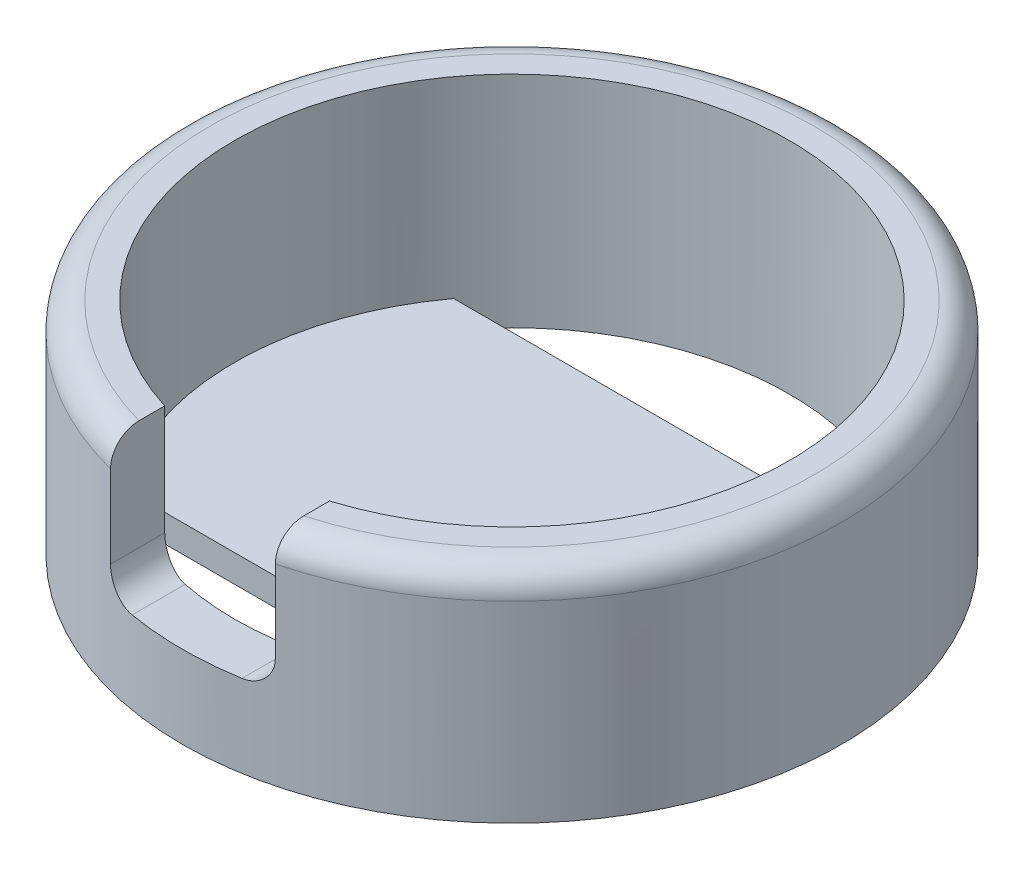
ISO-10303-21;
HEADER;
FILE_DESCRIPTION(('STEP AP214'),'2;1');
FILE_NAME('part.step','',(''),(''),'','','');
FILE_SCHEMA(('AUTOMOTIVE_DESIGN { 1 0 10303 214 1 1 1 1 }'));
ENDSEC;
DATA;
#1=APPLICATION_CONTEXT('core data for automotive mechanical design processes');
#2=APPLICATION_PROTOCOL_DEFINITION('international standard','automotive_design',2000,#1);
#3=PRODUCT_CONTEXT('',#1,'mechanical');
#4=PRODUCT('Part','Part','',(#3));
#5=PRODUCT_RELATED_PRODUCT_CATEGORY('part','',(#4));
#6=PRODUCT_DEFINITION_FORMATION('','',#4);
#7=PRODUCT_DEFINITION_CONTEXT('part definition',#1,'design');
#8=PRODUCT_DEFINITION('design','',#6,#7);
#9=PRODUCT_DEFINITION_SHAPE('','',#8);
#10=(LENGTH_UNIT() NAMED_UNIT(*) SI_UNIT(.MILLI.,.METRE.));
#11=(NAMED_UNIT(*) PLANE_ANGLE_UNIT() SI_UNIT($,.RADIAN.));
#12=(NAMED_UNIT(*) SI_UNIT($,.STERADIAN.) SOLID_ANGLE_UNIT());
#13=UNCERTAINTY_MEASURE_WITH_UNIT(LENGTH_MEASURE(1.E-05),#10,'distance_accuracy_value','');
#14=(GEOMETRIC_REPRESENTATION_CONTEXT(3) GLOBAL_UNCERTAINTY_ASSIGNED_CONTEXT((#13)) GLOBAL_UNIT_ASSIGNED_CONTEXT((#10,
#11,#12)) REPRESENTATION_CONTEXT('',''));
#15=CARTESIAN_POINT('',(0.,0.,0.));
#16=DIRECTION('',(0.,0.,1.));
#17=DIRECTION('',(1.,0.,0.));
#18=AXIS2_PLACEMENT_3D('',#15,#16,#17);
#19=CARTESIAN_POINT('',(0.,0.,0.));
#20=DIRECTION('',(0.,-1.,0.));
#21=DIRECTION('',(0.,0.,-1.));
#22=AXIS2_PLACEMENT_3D('',#19,#20,#21);
#23=PLANE('',#22);
#24=CARTESIAN_POINT('',(0.,0.,0.));
#25=DIRECTION('',(0.,1.,0.));
#26=DIRECTION('',(0.,0.,1.));
#27=AXIS2_PLACEMENT_3D('',#24,#25,#26);
#28=CIRCLE('',#27,5.05);
#29=CARTESIAN_POINT('',(4.06232691938992,0.,3.));
#30=VERTEX_POINT('',#29);
#31=CARTESIAN_POINT('',(4.06232691938992,0.,-3.));
#32=VERTEX_POINT('',#31);
#33=EDGE_CURVE('E172',#30,#32,#28,.T.);
#34=ORIENTED_EDGE('',*,*,#33,.T.);
#35=DIRECTION('',(1.,0.,0.));
#36=VECTOR('',#35,1.);
#37=CARTESIAN_POINT('',(4.06232691938992,0.,-3.));
#38=LINE('',#37,#36);
#39=CARTESIAN_POINT('',(-4.06232691938992,0.,-3.));
#40=VERTEX_POINT('',#39);
#41=EDGE_CURVE('E141',#40,#32,#38,.T.);
#42=ORIENTED_EDGE('',*,*,#41,.F.);
#43=CARTESIAN_POINT('',(-4.06232691938992,0.,3.));
#44=VERTEX_POINT('',#43);
#45=EDGE_CURVE('E129',#40,#44,#28,.T.);
#46=ORIENTED_EDGE('',*,*,#45,.T.);
#47=DIRECTION('',(-1.,0.,0.));
#48=VECTOR('',#47,1.);
#49=CARTESIAN_POINT('',(4.06232691938992,0.,3.));
#50=LINE('',#49,#48);
#51=EDGE_CURVE('E145',#30,#44,#50,.T.);
#52=ORIENTED_EDGE('',*,*,#51,.F.);
#53=EDGE_LOOP('',(#34,#42,#46,#52));
#54=FACE_BOUND('',#53,.T.);
#55=ADVANCED_FACE('F32',(#54),#23,.F.);
#56=CARTESIAN_POINT('',(0.,3.5,0.));
#57=DIRECTION('',(0.,1.,0.));
#58=DIRECTION('',(0.,0.,1.));
#59=AXIS2_PLACEMENT_3D('',#56,#57,#58);
#60=PLANE('',#59);
#61=DIRECTION('',(0.,0.,1.));
#62=VECTOR('',#61,1.);
#63=CARTESIAN_POINT('',(1.5,3.5,6.));
#64=LINE('',#63,#62);
#65=CARTESIAN_POINT('',(1.5,3.5,4.82208461145177));
#66=VERTEX_POINT('',#65);
#67=CARTESIAN_POINT('',(1.5,3.5,5.29150262212918));
#68=VERTEX_POINT('',#67);
#69=EDGE_CURVE('E156',#66,#68,#64,.T.);
#70=ORIENTED_EDGE('',*,*,#69,.T.);
#71=CARTESIAN_POINT('',(0.,3.5,0.));
#72=DIRECTION('',(0.,1.,0.));
#73=DIRECTION('',(0.,0.,1.));
#74=AXIS2_PLACEMENT_3D('',#71,#72,#73);
#75=CIRCLE('',#74,5.5);
#76=CARTESIAN_POINT('',(-1.5,3.5,5.29150262212918));
#77=VERTEX_POINT('',#76);
#78=EDGE_CURVE('E206',#68,#77,#75,.T.);
#79=ORIENTED_EDGE('',*,*,#78,.T.);
#80=DIRECTION('',(0.,0.,-1.));
#81=VECTOR('',#80,1.);
#82=CARTESIAN_POINT('',(-1.5,3.5,6.));
#83=LINE('',#82,#81);
#84=CARTESIAN_POINT('',(-1.5,3.5,4.82208461145177));
#85=VERTEX_POINT('',#84);
#86=EDGE_CURVE('E275',#77,#85,#83,.T.);
#87=ORIENTED_EDGE('',*,*,#86,.T.);
#88=CARTESIAN_POINT('',(0.,3.5,0.));
#89=DIRECTION('',(0.,1.,0.));
#90=DIRECTION('',(0.,0.,1.));
#91=AXIS2_PLACEMENT_3D('',#88,#89,#90);
#92=CIRCLE('',#91,5.05);
#93=EDGE_CURVE('E256',#66,#85,#92,.T.);
#94=ORIENTED_EDGE('',*,*,#93,.F.);
#95=EDGE_LOOP('',(#70,#79,#87,#94));
#96=FACE_BOUND('',#95,.T.);
#97=ADVANCED_FACE('F228',(#96),#60,.T.);
#98=CARTESIAN_POINT('',(0.,3.5,0.));
#99=DIRECTION('',(0.,-1.,0.));
#100=DIRECTION('',(0.,0.,-1.));
#101=AXIS2_PLACEMENT_3D('',#98,#99,#100);
#102=CYLINDRICAL_SURFACE('',#101,6.);
#103=CARTESIAN_POINT('',(0.,-0.5,0.));
#104=DIRECTION('',(0.,-1.,0.));
#105=DIRECTION('',(0.,0.,-1.));
#106=AXIS2_PLACEMENT_3D('',#103,#104,#105);
#107=CIRCLE('',#106,6.);
#108=CARTESIAN_POINT('',(0.,-0.5,-6.));
#109=VERTEX_POINT('',#108);
#110=EDGE_CURVE('E173',#109,#109,#107,.T.);
#111=ORIENTED_EDGE('',*,*,#110,.F.);
#112=EDGE_LOOP('',(#111));
#113=FACE_BOUND('',#112,.T.);
#114=DIRECTION('',(0.,-1.,0.));
#115=VECTOR('',#114,1.);
#116=CARTESIAN_POINT('',(-1.5,3.5,5.80947501931113));
#117=LINE('',#116,#115);
#118=CARTESIAN_POINT('',(-1.5,3.,5.80947501931113));
#119=VERTEX_POINT('',#118);
#120=CARTESIAN_POINT('',(-1.5,1.5,5.80947501931113));
#121=VERTEX_POINT('',#120);
#122=EDGE_CURVE('E265',#119,#121,#117,.T.);
#123=ORIENTED_EDGE('',*,*,#122,.F.);
#124=CARTESIAN_POINT('',(0.,3.,0.));
#125=DIRECTION('',(0.,1.,0.));
#126=DIRECTION('',(0.,0.,1.));
#127=AXIS2_PLACEMENT_3D('',#124,#125,#126);
#128=CIRCLE('',#127,6.);
#129=CARTESIAN_POINT('',(1.5,3.,5.80947501931113));
#130=VERTEX_POINT('',#129);
#131=EDGE_CURVE('E209',#119,#130,#128,.F.);
#132=ORIENTED_EDGE('',*,*,#131,.T.);
#133=DIRECTION('',(0.,-1.,0.));
#134=VECTOR('',#133,1.);
#135=CARTESIAN_POINT('',(1.5,3.5,5.80947501931113));
#136=LINE('',#135,#134);
#137=CARTESIAN_POINT('',(1.5,1.5,5.80947501931113));
#138=VERTEX_POINT('',#137);
#139=EDGE_CURVE('E263',#138,#130,#136,.F.);
#140=ORIENTED_EDGE('',*,*,#139,.F.);
#141=CARTESIAN_POINT('',(1.5,1.5,5.80947501931113));
#142=CARTESIAN_POINT('',(1.5000264388775,1.47245234394303,5.80946260272225));
#143=CARTESIAN_POINT('',(1.49772513568713,1.44491875321877,5.81006232529152));
#144=CARTESIAN_POINT('',(1.48867054127598,1.39069268979506,5.81239183886436));
#145=CARTESIAN_POINT('',(1.48192543696267,1.36399876473653,5.81411955169529));
#146=CARTESIAN_POINT('',(1.46418467978733,1.31215613754131,5.81861164863412));
#147=CARTESIAN_POINT('',(1.45318868844561,1.28700755863868,5.82137611529369));
#148=CARTESIAN_POINT('',(1.42730002983229,1.23892533964038,5.82777770640467));
#149=CARTESIAN_POINT('',(1.41240679471109,1.21599202298769,5.83141495801916));
#150=CARTESIAN_POINT('',(1.37888943193051,1.17257483931313,5.83943185842595));
#151=CARTESIAN_POINT('',(1.36020865851627,1.15213678395909,5.8438226013859));
#152=CARTESIAN_POINT('',(1.31979926314509,1.11465845161131,5.85308115729669));
#153=CARTESIAN_POINT('',(1.29806979139856,1.09761912519205,5.85794910314797));
#154=CARTESIAN_POINT('',(1.25151686538783,1.06694381207257,5.86807359237805));
#155=CARTESIAN_POINT('',(1.22662470361615,1.05341443104465,5.87333714435984));
#156=CARTESIAN_POINT('',(1.17492720494232,1.03074930338266,5.88389673242732));
#157=CARTESIAN_POINT('',(1.14812272134344,1.02161161102753,5.88919275307265));
#158=CARTESIAN_POINT('',(1.1010233989768,1.00989039601375,5.89814802867448));
#159=CARTESIAN_POINT('',(1.08100778606736,1.00618802406004,5.90185029888455));
#160=CARTESIAN_POINT('',(1.04067055279438,1.00124239117992,5.90909720818695));
#161=CARTESIAN_POINT('',(1.02034929701292,0.99999640343558,5.91264201779594));
#162=CARTESIAN_POINT('',(1.,1.,5.91607978309962));
#163=B_SPLINE_CURVE_WITH_KNOTS('',3,(#141,#142,#143,#144,#145,#146,#147,#148,#149,#150,#151,
#152,#153,#154,#155,#156,#157,#158,#159,#160,#161,#162),.UNSPECIFIED.,.F.,.F.,(4,2,2,2,2,2,2,2,
2,2,4),(0.,0.0825190739674022,0.164886544864223,0.247260575676911,0.329646615522718,
0.413370197857709,0.497117163713627,0.583169637417716,0.669183950673288,0.731109654210457,
0.792966575586024),.UNSPECIFIED.);
#164=CARTESIAN_POINT('',(1.,1.,5.91607978309962));
#165=VERTEX_POINT('',#164);
#166=EDGE_CURVE('E45',#138,#165,#163,.T.);
#167=ORIENTED_EDGE('',*,*,#166,.T.);
#168=CARTESIAN_POINT('',(0.,1.,0.));
#169=DIRECTION('',(0.,1.,0.));
#170=DIRECTION('',(0.,0.,1.));
#171=AXIS2_PLACEMENT_3D('',#168,#169,#170);
#172=CIRCLE('',#171,6.);
#173=CARTESIAN_POINT('',(-1.,1.,5.91607978309962));
#174=VERTEX_POINT('',#173);
#175=EDGE_CURVE('E268',#174,#165,#172,.T.);
#176=ORIENTED_EDGE('',*,*,#175,.F.);
#177=CARTESIAN_POINT('',(-1.,1.,5.91607978309962));
#178=CARTESIAN_POINT('',(-1.02863076528655,0.999978854490423,5.91124844688036));
#179=CARTESIAN_POINT('',(-1.0572122635172,1.00245763755017,5.90619562137501));
#180=CARTESIAN_POINT('',(-1.11347612360845,1.01221729737715,5.89584284522348));
#181=CARTESIAN_POINT('',(-1.14115914170437,1.01949458262758,5.89054308215667));
#182=CARTESIAN_POINT('',(-1.19487780890017,1.03865661381043,5.8798830515727));
#183=CARTESIAN_POINT('',(-1.22091301246864,1.05054259969208,5.87452276814994));
#184=CARTESIAN_POINT('',(-1.27060482095105,1.07858989055555,5.86397538489915));
#185=CARTESIAN_POINT('',(-1.29426165517847,1.09475078282027,5.85878826840729));
#186=CARTESIAN_POINT('',(-1.33855140011155,1.13094460117043,5.84882871455614));
#187=CARTESIAN_POINT('',(-1.35918081396686,1.15098194383714,5.84405675928205));
#188=CARTESIAN_POINT('',(-1.39676716424024,1.19438636263682,5.83518768297033));
#189=CARTESIAN_POINT('',(-1.41372368767373,1.21775381272213,5.83109063783287));
#190=CARTESIAN_POINT('',(-1.44315778903523,1.26673249328472,5.82387518217024));
#191=CARTESIAN_POINT('',(-1.45570777604623,1.2922979140944,5.82074106784856));
#192=CARTESIAN_POINT('',(-1.47630380393845,1.34527358514939,5.81555164563027));
#193=CARTESIAN_POINT('',(-1.48435435652112,1.37268195640367,5.81349525719888));
#194=CARTESIAN_POINT('',(-1.49333436328146,1.416931541816,5.81119297097694));
#195=CARTESIAN_POINT('',(-1.49583211860708,1.43344990261393,5.81054998706872));
#196=CARTESIAN_POINT('',(-1.49916462086055,1.46664269790988,5.80969073993498));
#197=CARTESIAN_POINT('',(-1.50000152561307,1.48331690157985,5.8094739230246));
#198=CARTESIAN_POINT('',(-1.5,1.5,5.80947501931113));
#199=B_SPLINE_CURVE_WITH_KNOTS('',3,(#177,#178,#179,#180,#181,#182,#183,#184,#185,#186,#187,
#188,#189,#190,#191,#192,#193,#194,#195,#196,#197,#198),.UNSPECIFIED.,.F.,.F.,(4,2,2,2,2,2,2,2,
2,2,4),(0.,0.086983738657892,0.173902446713839,0.260844556084092,0.347778274765876,
0.434811629800412,0.521854765904095,0.607392095030616,0.69284349903057,0.742918224722483,
0.792927849191008),.UNSPECIFIED.);
#200=EDGE_CURVE('E217',#174,#121,#199,.T.);
#201=ORIENTED_EDGE('',*,*,#200,.T.);
#202=EDGE_LOOP('',(#123,#132,#140,#167,#176,#201));
#203=FACE_BOUND('',#202,.T.);
#204=ADVANCED_FACE('F227',(#113,#203),#102,.T.);
#205=CARTESIAN_POINT('',(0.,3.5,0.));
#206=DIRECTION('',(0.,-1.,0.));
#207=DIRECTION('',(0.,0.,-1.));
#208=AXIS2_PLACEMENT_3D('',#205,#206,#207);
#209=CYLINDRICAL_SURFACE('',#208,5.05);
#210=ORIENTED_EDGE('',*,*,#33,.F.);
#211=DIRECTION('',(0.,1.,0.));
#212=VECTOR('',#211,1.);
#213=CARTESIAN_POINT('',(4.06232691938992,-0.5,3.));
#214=LINE('',#213,#212);
#215=CARTESIAN_POINT('',(4.06232691938992,-0.5,3.));
#216=VERTEX_POINT('',#215);
#217=EDGE_CURVE('E153',#216,#30,#214,.T.);
#218=ORIENTED_EDGE('',*,*,#217,.F.);
#219=CARTESIAN_POINT('',(0.,-0.5,0.));
#220=DIRECTION('',(0.,1.,0.));
#221=DIRECTION('',(0.,0.,1.));
#222=AXIS2_PLACEMENT_3D('',#219,#220,#221);
#223=CIRCLE('',#222,5.05);
#224=CARTESIAN_POINT('',(-4.06232691938992,-0.5,3.));
#225=VERTEX_POINT('',#224);
#226=EDGE_CURVE('E147',#225,#216,#223,.T.);
#227=ORIENTED_EDGE('',*,*,#226,.F.);
#228=DIRECTION('',(0.,1.,0.));
#229=VECTOR('',#228,1.);
#230=CARTESIAN_POINT('',(-4.06232691938992,-0.5,3.));
#231=LINE('',#230,#229);
#232=EDGE_CURVE('E165',#225,#44,#231,.T.);
#233=ORIENTED_EDGE('',*,*,#232,.T.);
#234=ORIENTED_EDGE('',*,*,#45,.F.);
#235=DIRECTION('',(0.,1.,0.));
#236=VECTOR('',#235,1.);
#237=CARTESIAN_POINT('',(-4.06232691938992,-0.5,-3.));
#238=LINE('',#237,#236);
#239=CARTESIAN_POINT('',(-4.06232691938992,-0.5,-3.));
#240=VERTEX_POINT('',#239);
#241=EDGE_CURVE('E120',#240,#40,#238,.T.);
#242=ORIENTED_EDGE('',*,*,#241,.F.);
#243=CARTESIAN_POINT('',(0.,-0.5,0.));
#244=DIRECTION('',(0.,1.,0.));
#245=DIRECTION('',(0.,0.,1.));
#246=AXIS2_PLACEMENT_3D('',#243,#244,#245);
#247=CIRCLE('',#246,5.05);
#248=CARTESIAN_POINT('',(4.06232691938992,-0.5,-3.));
#249=VERTEX_POINT('',#248);
#250=EDGE_CURVE('E126',#249,#240,#247,.T.);
#251=ORIENTED_EDGE('',*,*,#250,.F.);
#252=DIRECTION('',(0.,1.,0.));
#253=VECTOR('',#252,1.);
#254=CARTESIAN_POINT('',(4.06232691938992,-0.5,-3.));
#255=LINE('',#254,#253);
#256=EDGE_CURVE('E132',#249,#32,#255,.T.);
#257=ORIENTED_EDGE('',*,*,#256,.T.);
#258=EDGE_LOOP('',(#210,#218,#227,#233,#234,#242,#251,#257));
#259=FACE_BOUND('',#258,.T.);
#260=ORIENTED_EDGE('',*,*,#93,.T.);
#261=DIRECTION('',(0.,1.,0.));
#262=VECTOR('',#261,1.);
#263=CARTESIAN_POINT('',(-1.5,1.,4.82208461145177));
#264=LINE('',#263,#262);
#265=CARTESIAN_POINT('',(-1.5,1.5,4.82208461145177));
#266=VERTEX_POINT('',#265);
#267=EDGE_CURVE('E271',#266,#85,#264,.T.);
#268=ORIENTED_EDGE('',*,*,#267,.F.);
#269=CARTESIAN_POINT('',(-1.5,1.5,4.82208461145177));
#270=CARTESIAN_POINT('',(-1.50002741517374,1.47269558791309,4.82206946039489));
#271=CARTESIAN_POINT('',(-1.49776528529439,1.44540815482649,4.82277970502124));
#272=CARTESIAN_POINT('',(-1.48887604250776,1.39168411584854,4.82553483707274));
#273=CARTESIAN_POINT('',(-1.48225883208447,1.36524572212748,4.82757669660633));
#274=CARTESIAN_POINT('',(-1.46487257993356,1.31390838344403,4.83287963015573));
#275=CARTESIAN_POINT('',(-1.45410391505403,1.28900929898889,4.83614059350663));
#276=CARTESIAN_POINT('',(-1.42877428414757,1.24138865105463,4.84368447243576));
#277=CARTESIAN_POINT('',(-1.41421227378311,1.21866768958994,4.8479676694156));
#278=CARTESIAN_POINT('',(-1.38135665473592,1.17546890633589,4.85743260369414));
#279=CARTESIAN_POINT('',(-1.36298528637319,1.15505430599252,4.86263265824612));
#280=CARTESIAN_POINT('',(-1.32324544026832,1.11756175826031,4.87359682156284));
#281=CARTESIAN_POINT('',(-1.30187603841933,1.10048484357068,4.87936110407765));
#282=CARTESIAN_POINT('',(-1.25581452776838,1.06946553121153,4.89142288405382));
#283=CARTESIAN_POINT('',(-1.23102484372467,1.05567268888014,4.89773243387299));
#284=CARTESIAN_POINT('',(-1.17948870371423,1.03247281186565,4.91039809340183));
#285=CARTESIAN_POINT('',(-1.15274300198403,1.02306409688048,4.91675418432345));
#286=CARTESIAN_POINT('',(-1.10495844644195,1.0106848879549,4.92767749110444));
#287=CARTESIAN_POINT('',(-1.08419001066509,1.00668727809619,4.9322900285034));
#288=CARTESIAN_POINT('',(-1.04229377738949,1.00134404802128,4.94131451527166));
#289=CARTESIAN_POINT('',(-1.021166347105,0.999995865142374,4.94572665443611));
#290=CARTESIAN_POINT('',(-1.,1.,4.95));
#291=B_SPLINE_CURVE_WITH_KNOTS('',3,(#269,#270,#271,#272,#273,#274,#275,#276,#277,#278,#279,
#280,#281,#282,#283,#284,#285,#286,#287,#288,#289,#290),.UNSPECIFIED.,.F.,.F.,(4,2,2,2,2,2,2,2,
2,2,4),(0.,0.0817843497936587,0.163383379671818,0.244975004145126,0.32658911521148,
0.410070659418666,0.493577992550046,0.580367046267734,0.667122808976919,0.731904060636218,
0.796622621619724),.UNSPECIFIED.);
#292=CARTESIAN_POINT('',(-1.,1.,4.95));
#293=VERTEX_POINT('',#292);
#294=EDGE_CURVE('E211',#266,#293,#291,.T.);
#295=ORIENTED_EDGE('',*,*,#294,.T.);
#296=CARTESIAN_POINT('',(0.,1.,0.));
#297=DIRECTION('',(0.,1.,0.));
#298=DIRECTION('',(0.,0.,1.));
#299=AXIS2_PLACEMENT_3D('',#296,#297,#298);
#300=CIRCLE('',#299,5.05);
#301=CARTESIAN_POINT('',(1.,1.,4.95));
#302=VERTEX_POINT('',#301);
#303=EDGE_CURVE('E181',#293,#302,#300,.T.);
#304=ORIENTED_EDGE('',*,*,#303,.T.);
#305=CARTESIAN_POINT('',(1.,1.,4.95));
#306=CARTESIAN_POINT('',(1.02884583085239,0.999980107879086,4.94418250802043));
#307=CARTESIAN_POINT('',(1.0576234249248,1.00249467144436,4.93809678673231));
#308=CARTESIAN_POINT('',(1.11424248022178,1.01238497055646,4.92562454608072));
#309=CARTESIAN_POINT('',(1.14208462173703,1.01975708943024,4.91923825378855));
#310=CARTESIAN_POINT('',(1.19608303579401,1.03915702926773,4.90639007258431));
#311=CARTESIAN_POINT('',(1.22223901379435,1.05118566108082,4.89992817069631));
#312=CARTESIAN_POINT('',(1.27214235838391,1.07956923025692,4.88720938697788));
#313=CARTESIAN_POINT('',(1.29588985571694,1.0959239326061,4.88095249403109));
#314=CARTESIAN_POINT('',(1.3403415570802,1.13257778974985,4.86893386145401));
#315=CARTESIAN_POINT('',(1.36104019532742,1.15288400512184,4.86317303517771));
#316=CARTESIAN_POINT('',(1.39870929604587,1.19690009973935,4.85247325034377));
#317=CARTESIAN_POINT('',(1.41567949288543,1.22061022129626,4.84753435035011));
#318=CARTESIAN_POINT('',(1.44494381231234,1.27014717593821,4.83889091416373));
#319=CARTESIAN_POINT('',(1.45734379074192,1.29590665120238,4.8351587191126));
#320=CARTESIAN_POINT('',(1.47759649670734,1.34928824206508,4.82900837026719));
#321=CARTESIAN_POINT('',(1.4854546456856,1.37690809281471,4.82658865002531));
#322=CARTESIAN_POINT('',(1.4939208757369,1.42064822568249,4.82397241369409));
#323=CARTESIAN_POINT('',(1.49619877861742,1.43643344748113,4.82326583203644));
#324=CARTESIAN_POINT('',(1.49923797730015,1.46814294325817,4.82232169090234));
#325=CARTESIAN_POINT('',(1.50000117730589,1.48406701733765,4.82208354253993));
#326=CARTESIAN_POINT('',(1.5,1.5,4.82208461145177));
#327=B_SPLINE_CURVE_WITH_KNOTS('',3,(#305,#306,#307,#308,#309,#310,#311,#312,#313,#314,#315,
#316,#317,#318,#319,#320,#321,#322,#323,#324,#325,#326),.UNSPECIFIED.,.F.,.F.,(4,2,2,2,2,2,2,2,
2,2,4),(0.,0.0881520291884,0.176238499193389,0.264340314804062,0.352437345265317,
0.440693257654528,0.528955455771587,0.615021231735489,0.700984060315131,0.748805793260381,
0.796567369100738),.UNSPECIFIED.);
#328=CARTESIAN_POINT('',(1.5,1.5,4.82208461145177));
#329=VERTEX_POINT('',#328);
#330=EDGE_CURVE('E11',#302,#329,#327,.T.);
#331=ORIENTED_EDGE('',*,*,#330,.T.);
#332=DIRECTION('',(0.,1.,0.));
#333=VECTOR('',#332,1.);
#334=CARTESIAN_POINT('',(1.5,1.,4.82208461145177));
#335=LINE('',#334,#333);
#336=EDGE_CURVE('E274',#329,#66,#335,.T.);
#337=ORIENTED_EDGE('',*,*,#336,.T.);
#338=EDGE_LOOP('',(#260,#268,#295,#304,#331,#337));
#339=FACE_BOUND('',#338,.T.);
#340=ADVANCED_FACE('F123',(#259,#339),#209,.F.);
#341=CARTESIAN_POINT('',(0.,-0.5,0.));
#342=DIRECTION('',(0.,-1.,0.));
#343=DIRECTION('',(0.,0.,-1.));
#344=AXIS2_PLACEMENT_3D('',#341,#342,#343);
#345=PLANE('',#344);
#346=ORIENTED_EDGE('',*,*,#250,.T.);
#347=DIRECTION('',(1.,0.,0.));
#348=VECTOR('',#347,1.);
#349=CARTESIAN_POINT('',(4.06232691938992,-0.5,-3.));
#350=LINE('',#349,#348);
#351=EDGE_CURVE('E133',#240,#249,#350,.T.);
#352=ORIENTED_EDGE('',*,*,#351,.T.);
#353=EDGE_LOOP('',(#346,#352));
#354=FACE_BOUND('',#353,.T.);
#355=ORIENTED_EDGE('',*,*,#226,.T.);
#356=DIRECTION('',(-1.,0.,0.));
#357=VECTOR('',#356,1.);
#358=CARTESIAN_POINT('',(4.06232691938992,-0.5,3.));
#359=LINE('',#358,#357);
#360=EDGE_CURVE('E150',#216,#225,#359,.T.);
#361=ORIENTED_EDGE('',*,*,#360,.T.);
#362=EDGE_LOOP('',(#355,#361));
#363=FACE_BOUND('',#362,.T.);
#364=ORIENTED_EDGE('',*,*,#110,.T.);
#365=EDGE_LOOP('',(#364));
#366=FACE_BOUND('',#365,.T.);
#367=ADVANCED_FACE('F139',(#354,#363,#366),#345,.T.);
#368=CARTESIAN_POINT('',(1.5,1.,6.));
#369=DIRECTION('',(-1.,0.,0.));
#370=DIRECTION('',(0.,0.,1.));
#371=AXIS2_PLACEMENT_3D('',#368,#369,#370);
#372=PLANE('',#371);
#373=ORIENTED_EDGE('',*,*,#336,.F.);
#374=DIRECTION('',(0.,0.,1.));
#375=VECTOR('',#374,1.);
#376=CARTESIAN_POINT('',(1.5,1.5,5.80947501931113));
#377=LINE('',#376,#375);
#378=EDGE_CURVE('E202',#329,#138,#377,.T.);
#379=ORIENTED_EDGE('',*,*,#378,.T.);
#380=ORIENTED_EDGE('',*,*,#139,.T.);
#381=CARTESIAN_POINT('',(1.5,3.,5.80947501931113));
#382=CARTESIAN_POINT('',(1.5,3.02746760657096,5.80950227872987));
#383=CARTESIAN_POINT('',(1.5,3.0549232377484,5.80713916462104));
#384=CARTESIAN_POINT('',(1.5,3.10900436697722,5.79783908780219));
#385=CARTESIAN_POINT('',(1.5,3.13563114518827,5.79090958667919));
#386=CARTESIAN_POINT('',(1.5,3.18734787109026,5.77268065743451));
#387=CARTESIAN_POINT('',(1.5,3.21243752174102,5.76138038775566));
#388=CARTESIAN_POINT('',(1.5,3.26039693234626,5.73478226547778));
#389=CARTESIAN_POINT('',(1.5,3.283266561404,5.71948417735584));
#390=CARTESIAN_POINT('',(1.5,3.3264748795103,5.68513882339443));
#391=CARTESIAN_POINT('',(1.5,3.3467770956013,5.66604571946816));
#392=CARTESIAN_POINT('',(1.5,3.38400443166236,5.62480941825856));
#393=CARTESIAN_POINT('',(1.5,3.4009288169525,5.60266555920087));
#394=CARTESIAN_POINT('',(1.5,3.43147060867013,5.55524646013606));
#395=CARTESIAN_POINT('',(1.5,3.4449718834679,5.52989650764971));
#396=CARTESIAN_POINT('',(1.5,3.46768027998512,5.47734122678453));
#397=CARTESIAN_POINT('',(1.5,3.47688760747723,5.45013598738559));
#398=CARTESIAN_POINT('',(1.5,3.48922611245479,5.40099020189629));
#399=CARTESIAN_POINT('',(1.5,3.49326634705547,5.379272495983));
#400=CARTESIAN_POINT('',(1.5,3.49865330537333,5.33553892368698));
#401=CARTESIAN_POINT('',(1.5,3.50000411796428,5.31352356123787));
#402=CARTESIAN_POINT('',(1.5,3.5,5.29150262212918));
#403=B_SPLINE_CURVE_WITH_KNOTS('',3,(#381,#382,#383,#384,#385,#386,#387,#388,#389,#390,#391,
#392,#393,#394,#395,#396,#397,#398,#399,#400,#401,#402),.UNSPECIFIED.,.F.,.F.,(4,2,2,2,2,2,2,2,
2,2,4),(0.,0.0822832708119111,0.164432421055297,0.246597396353051,0.328767213316142,
0.411997497345877,0.49524586432401,0.581024187394145,0.666798399410376,0.732909058241704,
0.798919128474184),.UNSPECIFIED.);
#404=EDGE_CURVE('E58',#130,#68,#403,.T.);
#405=ORIENTED_EDGE('',*,*,#404,.T.);
#406=ORIENTED_EDGE('',*,*,#69,.F.);
#407=EDGE_LOOP('',(#373,#379,#380,#405,#406));
#408=FACE_BOUND('',#407,.T.);
#409=ADVANCED_FACE('F189',(#408),#372,.T.);
#410=CARTESIAN_POINT('',(-1.5,1.,6.));
#411=DIRECTION('',(1.,0.,0.));
#412=DIRECTION('',(0.,0.,-1.));
#413=AXIS2_PLACEMENT_3D('',#410,#411,#412);
#414=PLANE('',#413);
#415=ORIENTED_EDGE('',*,*,#122,.T.);
#416=DIRECTION('',(0.,0.,-1.));
#417=VECTOR('',#416,1.);
#418=CARTESIAN_POINT('',(-1.5,1.5,4.82208461145177));
#419=LINE('',#418,#417);
#420=EDGE_CURVE('E180',#121,#266,#419,.T.);
#421=ORIENTED_EDGE('',*,*,#420,.T.);
#422=ORIENTED_EDGE('',*,*,#267,.T.);
#423=ORIENTED_EDGE('',*,*,#86,.F.);
#424=CARTESIAN_POINT('',(-1.5,3.5,5.29150262212918));
#425=CARTESIAN_POINT('',(-1.5,3.50002089056905,5.32146688132314));
#426=CARTESIAN_POINT('',(-1.5,3.49750775655338,5.35143339537252));
#427=CARTESIAN_POINT('',(-1.5,3.48753733434825,5.41054663910723));
#428=CARTESIAN_POINT('',(-1.5,3.48007768483638,5.43969297033068));
#429=CARTESIAN_POINT('',(-1.5,3.4603284321407,5.49633976133888));
#430=CARTESIAN_POINT('',(-1.5,3.44803398445085,5.52383853831459));
#431=CARTESIAN_POINT('',(-1.5,3.4189124956653,5.57630701047069));
#432=CARTESIAN_POINT('',(-1.5,3.40208802284603,5.6012781276921));
#433=CARTESIAN_POINT('',(-1.5,3.36473174676593,5.64740929624115));
#434=CARTESIAN_POINT('',(-1.5,3.34428540052066,5.66863848245369));
#435=CARTESIAN_POINT('',(-1.5,3.30000021358724,5.70722040134455));
#436=CARTESIAN_POINT('',(-1.5,3.27616095596466,5.7245726569358));
#437=CARTESIAN_POINT('',(-1.5,3.22664700731093,5.75427554639923));
#438=CARTESIAN_POINT('',(-1.5,3.20106187189186,5.76677572525865));
#439=CARTESIAN_POINT('',(-1.5,3.14812504039779,5.78715159880962));
#440=CARTESIAN_POINT('',(-1.5,3.12077527794507,5.79503226300242));
#441=CARTESIAN_POINT('',(-1.5,3.07765491319325,5.80346381239056));
#442=CARTESIAN_POINT('',(-1.5,3.06219859733672,5.80571701057418));
#443=CARTESIAN_POINT('',(-1.5,3.03116409347343,5.80872189305115));
#444=CARTESIAN_POINT('',(-1.5,3.01558612253667,5.80947581996945));
#445=CARTESIAN_POINT('',(-1.5,3.0000000000001,5.80947501931164));
#446=B_SPLINE_CURVE_WITH_KNOTS('',3,(#424,#425,#426,#427,#428,#429,#430,#431,#432,#433,#434,
#435,#436,#437,#438,#439,#440,#441,#442,#443,#444,#445),.UNSPECIFIED.,.F.,.F.,(4,2,2,2,2,2,2,2,
2,2,4),(0.,0.0897921223172493,0.179627139665921,0.26955240271703,0.35942679002423,
0.447410079802145,0.535404190665838,0.62041687920606,0.705337945636612,0.752132136344542,
0.798856279026414),.UNSPECIFIED.);
#447=EDGE_CURVE('E174',#77,#119,#446,.T.);
#448=ORIENTED_EDGE('',*,*,#447,.T.);
#449=EDGE_LOOP('',(#415,#421,#422,#423,#448));
#450=FACE_BOUND('',#449,.T.);
#451=ADVANCED_FACE('F183',(#450),#414,.T.);
#452=CARTESIAN_POINT('',(0.,1.,0.));
#453=DIRECTION('',(0.,1.,0.));
#454=DIRECTION('',(0.,0.,1.));
#455=AXIS2_PLACEMENT_3D('',#452,#453,#454);
#456=PLANE('',#455);
#457=ORIENTED_EDGE('',*,*,#303,.F.);
#458=DIRECTION('',(0.,0.,-1.));
#459=VECTOR('',#458,1.);
#460=CARTESIAN_POINT('',(-1.,1.,5.80947501931113));
#461=LINE('',#460,#459);
#462=EDGE_CURVE('E203',#293,#174,#461,.F.);
#463=ORIENTED_EDGE('',*,*,#462,.T.);
#464=ORIENTED_EDGE('',*,*,#175,.T.);
#465=DIRECTION('',(0.,0.,1.));
#466=VECTOR('',#465,1.);
#467=CARTESIAN_POINT('',(1.,1.,4.82208461145177));
#468=LINE('',#467,#466);
#469=EDGE_CURVE('E289',#165,#302,#468,.F.);
#470=ORIENTED_EDGE('',*,*,#469,.T.);
#471=EDGE_LOOP('',(#457,#463,#464,#470));
#472=FACE_BOUND('',#471,.T.);
#473=ADVANCED_FACE('F188',(#472),#456,.T.);
#474=CARTESIAN_POINT('',(4.06232691938992,-0.5,3.));
#475=DIRECTION('',(0.,0.,-1.));
#476=DIRECTION('',(-1.,0.,0.));
#477=AXIS2_PLACEMENT_3D('',#474,#475,#476);
#478=PLANE('',#477);
#479=ORIENTED_EDGE('',*,*,#51,.T.);
#480=ORIENTED_EDGE('',*,*,#232,.F.);
#481=ORIENTED_EDGE('',*,*,#360,.F.);
#482=ORIENTED_EDGE('',*,*,#217,.T.);
#483=EDGE_LOOP('',(#479,#480,#481,#482));
#484=FACE_BOUND('',#483,.T.);
#485=ADVANCED_FACE('F295',(#484),#478,.F.);
#486=CARTESIAN_POINT('',(4.06232691938992,-0.5,-3.));
#487=DIRECTION('',(0.,0.,1.));
#488=DIRECTION('',(1.,0.,0.));
#489=AXIS2_PLACEMENT_3D('',#486,#487,#488);
#490=PLANE('',#489);
#491=ORIENTED_EDGE('',*,*,#41,.T.);
#492=ORIENTED_EDGE('',*,*,#256,.F.);
#493=ORIENTED_EDGE('',*,*,#351,.F.);
#494=ORIENTED_EDGE('',*,*,#241,.T.);
#495=EDGE_LOOP('',(#491,#492,#493,#494));
#496=FACE_BOUND('',#495,.T.);
#497=ADVANCED_FACE('F136',(#496),#490,.F.);
#498=CARTESIAN_POINT('',(-1.,1.5,6.));
#499=DIRECTION('',(0.,0.,1.));
#500=DIRECTION('',(1.,0.,0.));
#501=AXIS2_PLACEMENT_3D('',#498,#499,#500);
#502=CYLINDRICAL_SURFACE('',#501,0.5);
#503=ORIENTED_EDGE('',*,*,#200,.F.);
#504=ORIENTED_EDGE('',*,*,#462,.F.);
#505=ORIENTED_EDGE('',*,*,#294,.F.);
#506=ORIENTED_EDGE('',*,*,#420,.F.);
#507=EDGE_LOOP('',(#503,#504,#505,#506));
#508=FACE_BOUND('',#507,.T.);
#509=ADVANCED_FACE('F222',(#508),#502,.F.);
#510=CARTESIAN_POINT('',(1.,1.5,6.));
#511=DIRECTION('',(0.,0.,-1.));
#512=DIRECTION('',(-1.,0.,0.));
#513=AXIS2_PLACEMENT_3D('',#510,#511,#512);
#514=CYLINDRICAL_SURFACE('',#513,0.5);
#515=ORIENTED_EDGE('',*,*,#330,.F.);
#516=ORIENTED_EDGE('',*,*,#469,.F.);
#517=ORIENTED_EDGE('',*,*,#166,.F.);
#518=ORIENTED_EDGE('',*,*,#378,.F.);
#519=EDGE_LOOP('',(#515,#516,#517,#518));
#520=FACE_BOUND('',#519,.T.);
#521=ADVANCED_FACE('F239',(#520),#514,.F.);
#522=CARTESIAN_POINT('',(0.,3.,0.));
#523=DIRECTION('',(0.,1.,0.));
#524=DIRECTION('',(0.,0.,1.));
#525=AXIS2_PLACEMENT_3D('',#522,#523,#524);
#526=TOROIDAL_SURFACE('',#525,5.5,0.5);
#527=ORIENTED_EDGE('',*,*,#404,.F.);
#528=ORIENTED_EDGE('',*,*,#131,.F.);
#529=ORIENTED_EDGE('',*,*,#447,.F.);
#530=ORIENTED_EDGE('',*,*,#78,.F.);
#531=EDGE_LOOP('',(#527,#528,#529,#530));
#532=FACE_BOUND('',#531,.T.);
#533=ADVANCED_FACE('F34',(#532),#526,.T.);
#534=CLOSED_SHELL('',(#55,#97,#204,#340,#367,#409,#451,#473,#485,#497,#509,#521,#533));
#535=MANIFOLD_SOLID_BREP('B2',#534);
#536=ADVANCED_BREP_SHAPE_REPRESENTATION('',(#18,#535),#14);
#537=SHAPE_DEFINITION_REPRESENTATION(#9,#536);
ENDSEC;
END-ISO-10303-21;
